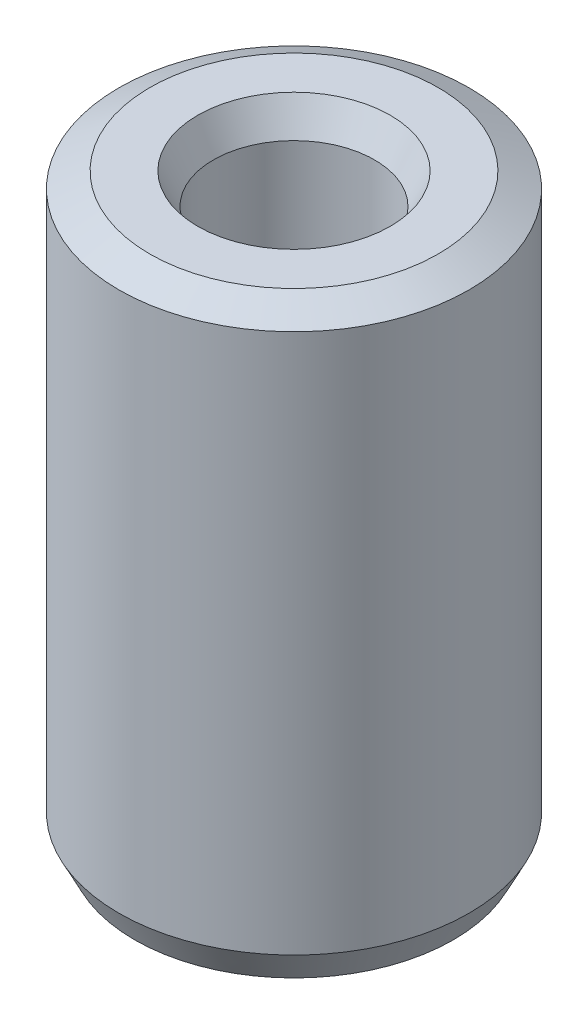
ISO-10303-21;
HEADER;
FILE_DESCRIPTION(('STEP AP214'),'2;1');
FILE_NAME('part.step','',(''),(''),'','','');
FILE_SCHEMA(('AUTOMOTIVE_DESIGN { 1 0 10303 214 1 1 1 1 }'));
ENDSEC;
DATA;
#1=APPLICATION_CONTEXT('core data for automotive mechanical design processes');
#2=APPLICATION_PROTOCOL_DEFINITION('international standard','automotive_design',2000,#1);
#3=PRODUCT_CONTEXT('',#1,'mechanical');
#4=PRODUCT('Part','Part','',(#3));
#5=PRODUCT_RELATED_PRODUCT_CATEGORY('part','',(#4));
#6=PRODUCT_DEFINITION_FORMATION('','',#4);
#7=PRODUCT_DEFINITION_CONTEXT('part definition',#1,'design');
#8=PRODUCT_DEFINITION('design','',#6,#7);
#9=PRODUCT_DEFINITION_SHAPE('','',#8);
#10=(LENGTH_UNIT() NAMED_UNIT(*) SI_UNIT(.MILLI.,.METRE.));
#11=(NAMED_UNIT(*) PLANE_ANGLE_UNIT() SI_UNIT($,.RADIAN.));
#12=(NAMED_UNIT(*) SI_UNIT($,.STERADIAN.) SOLID_ANGLE_UNIT());
#13=UNCERTAINTY_MEASURE_WITH_UNIT(LENGTH_MEASURE(1.E-05),#10,'distance_accuracy_value','');
#14=(GEOMETRIC_REPRESENTATION_CONTEXT(3) GLOBAL_UNCERTAINTY_ASSIGNED_CONTEXT((#13)) GLOBAL_UNIT_ASSIGNED_CONTEXT((#10,
#11,#12)) REPRESENTATION_CONTEXT('',''));
#15=CARTESIAN_POINT('',(0.,0.,0.));
#16=DIRECTION('',(0.,0.,1.));
#17=DIRECTION('',(1.,0.,0.));
#18=AXIS2_PLACEMENT_3D('',#15,#16,#17);
#19=CARTESIAN_POINT('',(0.,16.7458012657745,0.));
#20=DIRECTION('',(0.,-1.,0.));
#21=DIRECTION('',(0.,0.,-1.));
#22=AXIS2_PLACEMENT_3D('',#19,#20,#21);
#23=CYLINDRICAL_SURFACE('',#22,5.);
#24=CARTESIAN_POINT('',(0.,0.881542029742038,0.));
#25=DIRECTION('',(0.,1.,0.));
#26=DIRECTION('',(0.,0.,1.));
#27=AXIS2_PLACEMENT_3D('',#24,#25,#26);
#28=CIRCLE('',#27,5.);
#29=CARTESIAN_POINT('',(0.,0.881542029742038,5.));
#30=VERTEX_POINT('',#29);
#31=EDGE_CURVE('E10',#30,#30,#28,.T.);
#32=ORIENTED_EDGE('',*,*,#31,.T.);
#33=EDGE_LOOP('',(#32));
#34=FACE_BOUND('',#33,.T.);
#35=CARTESIAN_POINT('',(0.,16.2996176891239,0.));
#36=DIRECTION('',(0.,1.,0.));
#37=DIRECTION('',(0.,0.,1.));
#38=AXIS2_PLACEMENT_3D('',#35,#36,#37);
#39=CIRCLE('',#38,5.);
#40=CARTESIAN_POINT('',(0.,16.2996176891239,5.));
#41=VERTEX_POINT('',#40);
#42=EDGE_CURVE('E50',#41,#41,#39,.F.);
#43=ORIENTED_EDGE('',*,*,#42,.T.);
#44=EDGE_LOOP('',(#43));
#45=FACE_BOUND('',#44,.T.);
#46=ADVANCED_FACE('F39',(#34,#45),#23,.T.);
#47=CARTESIAN_POINT('',(0.,16.7458012657745,0.));
#48=DIRECTION('',(0.,1.,0.));
#49=DIRECTION('',(0.,0.,1.));
#50=AXIS2_PLACEMENT_3D('',#47,#48,#49);
#51=PLANE('',#50);
#52=CARTESIAN_POINT('',(0.,16.7458012657745,0.));
#53=DIRECTION('',(0.,1.,0.));
#54=DIRECTION('',(0.,0.,1.));
#55=AXIS2_PLACEMENT_3D('',#52,#53,#54);
#56=CIRCLE('',#55,2.74947979389545);
#57=CARTESIAN_POINT('',(0.,16.7458012657745,2.74947979389545));
#58=VERTEX_POINT('',#57);
#59=EDGE_CURVE('E58',#58,#58,#56,.F.);
#60=ORIENTED_EDGE('',*,*,#59,.T.);
#61=EDGE_LOOP('',(#60));
#62=FACE_BOUND('',#61,.T.);
#63=CARTESIAN_POINT('',(0.,16.7458012657745,0.));
#64=DIRECTION('',(0.,1.,0.));
#65=DIRECTION('',(0.,0.,1.));
#66=AXIS2_PLACEMENT_3D('',#63,#64,#65);
#67=CIRCLE('',#66,4.11845797025795);
#68=CARTESIAN_POINT('',(0.,16.7458012657745,4.11845797025795));
#69=VERTEX_POINT('',#68);
#70=EDGE_CURVE('E61',#69,#69,#67,.T.);
#71=ORIENTED_EDGE('',*,*,#70,.T.);
#72=EDGE_LOOP('',(#71));
#73=FACE_BOUND('',#72,.T.);
#74=ADVANCED_FACE('F88',(#62,#73),#51,.T.);
#75=CARTESIAN_POINT('',(0.,0.,0.));
#76=DIRECTION('',(0.,1.,0.));
#77=DIRECTION('',(0.,0.,1.));
#78=AXIS2_PLACEMENT_3D('',#75,#76,#77);
#79=PLANE('',#78);
#80=CARTESIAN_POINT('',(0.,0.,0.));
#81=DIRECTION('',(0.,1.,0.));
#82=DIRECTION('',(0.,0.,1.));
#83=AXIS2_PLACEMENT_3D('',#80,#81,#82);
#84=CIRCLE('',#83,3.18483824698692);
#85=CARTESIAN_POINT('',(0.,0.,3.18483824698692));
#86=VERTEX_POINT('',#85);
#87=EDGE_CURVE('E51',#86,#86,#84,.T.);
#88=ORIENTED_EDGE('',*,*,#87,.T.);
#89=EDGE_LOOP('',(#88));
#90=FACE_BOUND('',#89,.T.);
#91=CARTESIAN_POINT('',(0.,0.,0.));
#92=DIRECTION('',(0.,1.,0.));
#93=DIRECTION('',(0.,0.,1.));
#94=AXIS2_PLACEMENT_3D('',#91,#92,#93);
#95=CIRCLE('',#94,4.55381642334943);
#96=CARTESIAN_POINT('',(0.,0.,4.55381642334943));
#97=VERTEX_POINT('',#96);
#98=EDGE_CURVE('E54',#97,#97,#95,.F.);
#99=ORIENTED_EDGE('',*,*,#98,.T.);
#100=EDGE_LOOP('',(#99));
#101=FACE_BOUND('',#100,.T.);
#102=ADVANCED_FACE('F83',(#90,#101),#79,.F.);
#103=CARTESIAN_POINT('',(0.,16.7458012657745,0.));
#104=DIRECTION('',(0.,-1.,0.));
#105=DIRECTION('',(0.,0.,-1.));
#106=AXIS2_PLACEMENT_3D('',#103,#104,#105);
#107=CYLINDRICAL_SURFACE('',#106,2.30329621724487);
#108=CARTESIAN_POINT('',(0.,15.8642592360324,0.));
#109=DIRECTION('',(0.,1.,0.));
#110=DIRECTION('',(0.,0.,1.));
#111=AXIS2_PLACEMENT_3D('',#108,#109,#110);
#112=CIRCLE('',#111,2.30329621724487);
#113=CARTESIAN_POINT('',(0.,15.8642592360324,2.30329621724487));
#114=VERTEX_POINT('',#113);
#115=EDGE_CURVE('E67',#114,#114,#112,.T.);
#116=ORIENTED_EDGE('',*,*,#115,.T.);
#117=EDGE_LOOP('',(#116));
#118=FACE_BOUND('',#117,.T.);
#119=CARTESIAN_POINT('',(0.,0.44618357665057,0.));
#120=DIRECTION('',(0.,1.,0.));
#121=DIRECTION('',(0.,0.,1.));
#122=AXIS2_PLACEMENT_3D('',#119,#120,#121);
#123=CIRCLE('',#122,2.30329621724487);
#124=CARTESIAN_POINT('',(0.,0.44618357665057,2.30329621724487));
#125=VERTEX_POINT('',#124);
#126=EDGE_CURVE('E69',#125,#125,#123,.F.);
#127=ORIENTED_EDGE('',*,*,#126,.T.);
#128=EDGE_LOOP('',(#127));
#129=FACE_BOUND('',#128,.T.);
#130=ADVANCED_FACE('F71',(#118,#129),#107,.F.);
#131=CARTESIAN_POINT('',(0.,15.8642592360324,0.));
#132=DIRECTION('',(0.,1.,0.));
#133=DIRECTION('',(0.,0.,1.));
#134=AXIS2_PLACEMENT_3D('',#131,#132,#133);
#135=CONICAL_SURFACE('',#134,2.30329621724487,0.468547439492513);
#136=ORIENTED_EDGE('',*,*,#59,.F.);
#137=EDGE_LOOP('',(#136));
#138=FACE_BOUND('',#137,.T.);
#139=ORIENTED_EDGE('',*,*,#115,.F.);
#140=EDGE_LOOP('',(#139));
#141=FACE_BOUND('',#140,.T.);
#142=ADVANCED_FACE('F77',(#138,#141),#135,.F.);
#143=CARTESIAN_POINT('',(0.,0.,0.));
#144=DIRECTION('',(0.,-1.,0.));
#145=DIRECTION('',(0.,0.,-1.));
#146=AXIS2_PLACEMENT_3D('',#143,#144,#145);
#147=CONICAL_SURFACE('',#146,3.18483824698692,1.10224888730238);
#148=ORIENTED_EDGE('',*,*,#126,.F.);
#149=EDGE_LOOP('',(#148));
#150=FACE_BOUND('',#149,.T.);
#151=ORIENTED_EDGE('',*,*,#87,.F.);
#152=EDGE_LOOP('',(#151));
#153=FACE_BOUND('',#152,.T.);
#154=ADVANCED_FACE('F73',(#150,#153),#147,.F.);
#155=CARTESIAN_POINT('',(0.,0.881542029742038,0.));
#156=DIRECTION('',(0.,1.,0.));
#157=DIRECTION('',(0.,0.,1.));
#158=AXIS2_PLACEMENT_3D('',#155,#156,#157);
#159=CONICAL_SURFACE('',#158,5.,0.468547439492514);
#160=ORIENTED_EDGE('',*,*,#98,.F.);
#161=EDGE_LOOP('',(#160));
#162=FACE_BOUND('',#161,.T.);
#163=ORIENTED_EDGE('',*,*,#31,.F.);
#164=EDGE_LOOP('',(#163));
#165=FACE_BOUND('',#164,.T.);
#166=ADVANCED_FACE('F76',(#162,#165),#159,.T.);
#167=CARTESIAN_POINT('',(0.,16.7458012657745,0.));
#168=DIRECTION('',(0.,-1.,0.));
#169=DIRECTION('',(0.,0.,-1.));
#170=AXIS2_PLACEMENT_3D('',#167,#168,#169);
#171=CONICAL_SURFACE('',#170,4.11845797025795,1.10224888730238);
#172=ORIENTED_EDGE('',*,*,#42,.F.);
#173=EDGE_LOOP('',(#172));
#174=FACE_BOUND('',#173,.T.);
#175=ORIENTED_EDGE('',*,*,#70,.F.);
#176=EDGE_LOOP('',(#175));
#177=FACE_BOUND('',#176,.T.);
#178=ADVANCED_FACE('F45',(#174,#177),#171,.T.);
#179=CLOSED_SHELL('',(#46,#74,#102,#130,#142,#154,#166,#178));
#180=MANIFOLD_SOLID_BREP('B2',#179);
#181=ADVANCED_BREP_SHAPE_REPRESENTATION('',(#18,#180),#14);
#182=SHAPE_DEFINITION_REPRESENTATION(#9,#181);
ENDSEC;
END-ISO-10303-21;
